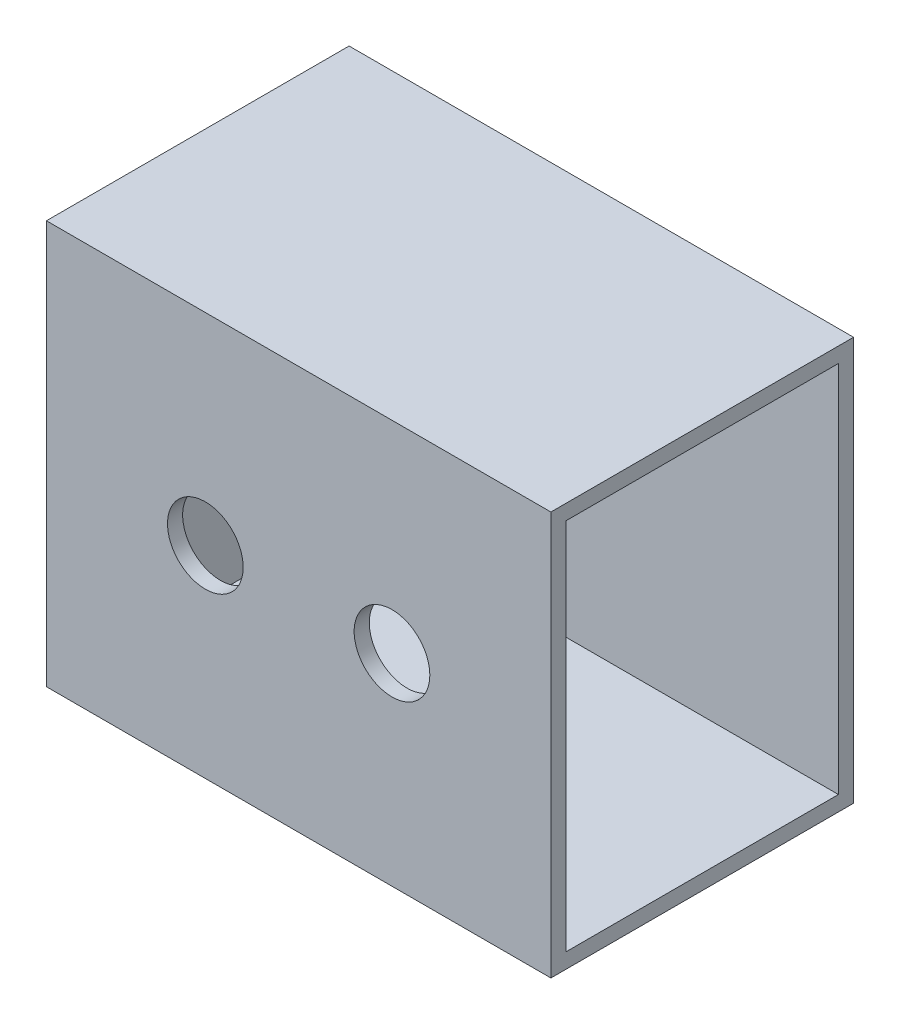
ISO-10303-21;
HEADER;
FILE_DESCRIPTION(('STEP AP214'),'2;1');
FILE_NAME('part.step','',(''),(''),'','','');
FILE_SCHEMA(('AUTOMOTIVE_DESIGN { 1 0 10303 214 1 1 1 1 }'));
ENDSEC;
DATA;
#1=APPLICATION_CONTEXT('core data for automotive mechanical design processes');
#2=APPLICATION_PROTOCOL_DEFINITION('international standard','automotive_design',2000,#1);
#3=PRODUCT_CONTEXT('',#1,'mechanical');
#4=PRODUCT('Part','Part','',(#3));
#5=PRODUCT_RELATED_PRODUCT_CATEGORY('part','',(#4));
#6=PRODUCT_DEFINITION_FORMATION('','',#4);
#7=PRODUCT_DEFINITION_CONTEXT('part definition',#1,'design');
#8=PRODUCT_DEFINITION('design','',#6,#7);
#9=PRODUCT_DEFINITION_SHAPE('','',#8);
#10=(LENGTH_UNIT() NAMED_UNIT(*) SI_UNIT(.MILLI.,.METRE.));
#11=(NAMED_UNIT(*) PLANE_ANGLE_UNIT() SI_UNIT($,.RADIAN.));
#12=(NAMED_UNIT(*) SI_UNIT($,.STERADIAN.) SOLID_ANGLE_UNIT());
#13=UNCERTAINTY_MEASURE_WITH_UNIT(LENGTH_MEASURE(1.E-05),#10,'distance_accuracy_value','');
#14=(GEOMETRIC_REPRESENTATION_CONTEXT(3) GLOBAL_UNCERTAINTY_ASSIGNED_CONTEXT((#13)) GLOBAL_UNIT_ASSIGNED_CONTEXT((#10,
#11,#12)) REPRESENTATION_CONTEXT('',''));
#15=CARTESIAN_POINT('',(0.,0.,0.));
#16=DIRECTION('',(0.,0.,1.));
#17=DIRECTION('',(1.,0.,0.));
#18=AXIS2_PLACEMENT_3D('',#15,#16,#17);
#19=CARTESIAN_POINT('',(46.25,40.,3.));
#20=DIRECTION('',(0.,0.,-1.));
#21=DIRECTION('',(-1.,0.,0.));
#22=AXIS2_PLACEMENT_3D('',#19,#20,#21);
#23=PLANE('',#22);
#24=DIRECTION('',(0.,1.,0.));
#25=VECTOR('',#24,1.);
#26=CARTESIAN_POINT('',(50.,37.,3.));
#27=LINE('',#26,#25);
#28=CARTESIAN_POINT('',(50.,-37.,3.));
#29=VERTEX_POINT('',#28);
#30=CARTESIAN_POINT('',(50.,37.,3.));
#31=VERTEX_POINT('',#30);
#32=EDGE_CURVE('E116',#29,#31,#27,.T.);
#33=ORIENTED_EDGE('',*,*,#32,.T.);
#34=DIRECTION('',(1.,0.,0.));
#35=VECTOR('',#34,1.);
#36=CARTESIAN_POINT('',(-46.25,37.,3.00000000000001));
#37=LINE('',#36,#35);
#38=CARTESIAN_POINT('',(-46.25,37.,3.00000000000001));
#39=VERTEX_POINT('',#38);
#40=EDGE_CURVE('E49',#39,#31,#37,.T.);
#41=ORIENTED_EDGE('',*,*,#40,.F.);
#42=DIRECTION('',(0.,-1.,0.));
#43=VECTOR('',#42,1.);
#44=CARTESIAN_POINT('',(-46.25,40.,3.00000000000001));
#45=LINE('',#44,#43);
#46=CARTESIAN_POINT('',(-46.25,-37.,3.));
#47=VERTEX_POINT('',#46);
#48=EDGE_CURVE('E129',#39,#47,#45,.T.);
#49=ORIENTED_EDGE('',*,*,#48,.T.);
#50=DIRECTION('',(1.,0.,0.));
#51=VECTOR('',#50,1.);
#52=CARTESIAN_POINT('',(46.25,-37.,3.));
#53=LINE('',#52,#51);
#54=EDGE_CURVE('E109',#47,#29,#53,.T.);
#55=ORIENTED_EDGE('',*,*,#54,.T.);
#56=EDGE_LOOP('',(#33,#41,#49,#55));
#57=FACE_BOUND('',#56,.T.);
#58=ADVANCED_FACE('F34',(#57),#23,.F.);
#59=CARTESIAN_POINT('',(-46.25,-37.,60.));
#60=DIRECTION('',(0.,1.,0.));
#61=DIRECTION('',(0.,0.,1.));
#62=AXIS2_PLACEMENT_3D('',#59,#60,#61);
#63=PLANE('',#62);
#64=DIRECTION('',(0.,0.,-1.));
#65=VECTOR('',#64,1.);
#66=CARTESIAN_POINT('',(50.,-37.,57.));
#67=LINE('',#66,#65);
#68=CARTESIAN_POINT('',(50.,-37.,57.));
#69=VERTEX_POINT('',#68);
#70=EDGE_CURVE('E120',#69,#29,#67,.T.);
#71=ORIENTED_EDGE('',*,*,#70,.T.);
#72=ORIENTED_EDGE('',*,*,#54,.F.);
#73=DIRECTION('',(0.,0.,-1.));
#74=VECTOR('',#73,1.);
#75=CARTESIAN_POINT('',(-46.25,-37.,60.));
#76=LINE('',#75,#74);
#77=CARTESIAN_POINT('',(-46.25,-37.,57.));
#78=VERTEX_POINT('',#77);
#79=EDGE_CURVE('E57',#78,#47,#76,.T.);
#80=ORIENTED_EDGE('',*,*,#79,.F.);
#81=DIRECTION('',(-1.,0.,0.));
#82=VECTOR('',#81,1.);
#83=CARTESIAN_POINT('',(46.25,-37.,57.));
#84=LINE('',#83,#82);
#85=EDGE_CURVE('E122',#69,#78,#84,.T.);
#86=ORIENTED_EDGE('',*,*,#85,.F.);
#87=EDGE_LOOP('',(#71,#72,#80,#86));
#88=FACE_BOUND('',#87,.T.);
#89=ADVANCED_FACE('F186',(#88),#63,.T.);
#90=CARTESIAN_POINT('',(-46.25,37.,60.));
#91=DIRECTION('',(1.,0.,0.));
#92=DIRECTION('',(0.,0.,-1.));
#93=AXIS2_PLACEMENT_3D('',#90,#91,#92);
#94=PLANE('',#93);
#95=DIRECTION('',(0.,0.,-1.));
#96=VECTOR('',#95,1.);
#97=CARTESIAN_POINT('',(-46.25,37.,60.));
#98=LINE('',#97,#96);
#99=CARTESIAN_POINT('',(-46.25,37.,57.));
#100=VERTEX_POINT('',#99);
#101=EDGE_CURVE('E133',#100,#39,#98,.T.);
#102=ORIENTED_EDGE('',*,*,#101,.F.);
#103=DIRECTION('',(0.,-1.,0.));
#104=VECTOR('',#103,1.);
#105=CARTESIAN_POINT('',(-46.25,40.,57.));
#106=LINE('',#105,#104);
#107=EDGE_CURVE('E107',#100,#78,#106,.T.);
#108=ORIENTED_EDGE('',*,*,#107,.T.);
#109=ORIENTED_EDGE('',*,*,#79,.T.);
#110=ORIENTED_EDGE('',*,*,#48,.F.);
#111=EDGE_LOOP('',(#102,#108,#109,#110));
#112=FACE_BOUND('',#111,.T.);
#113=ADVANCED_FACE('F192',(#112),#94,.T.);
#114=CARTESIAN_POINT('',(-46.25,37.,60.));
#115=DIRECTION('',(0.,-1.,0.));
#116=DIRECTION('',(0.,0.,-1.));
#117=AXIS2_PLACEMENT_3D('',#114,#115,#116);
#118=PLANE('',#117);
#119=DIRECTION('',(-1.,0.,0.));
#120=VECTOR('',#119,1.);
#121=CARTESIAN_POINT('',(-46.25,37.,57.));
#122=LINE('',#121,#120);
#123=CARTESIAN_POINT('',(50.,37.,57.));
#124=VERTEX_POINT('',#123);
#125=EDGE_CURVE('E102',#124,#100,#122,.T.);
#126=ORIENTED_EDGE('',*,*,#125,.T.);
#127=ORIENTED_EDGE('',*,*,#101,.T.);
#128=ORIENTED_EDGE('',*,*,#40,.T.);
#129=DIRECTION('',(0.,0.,1.));
#130=VECTOR('',#129,1.);
#131=CARTESIAN_POINT('',(50.,37.,57.));
#132=LINE('',#131,#130);
#133=EDGE_CURVE('E112',#31,#124,#132,.T.);
#134=ORIENTED_EDGE('',*,*,#133,.T.);
#135=EDGE_LOOP('',(#126,#127,#128,#134));
#136=FACE_BOUND('',#135,.T.);
#137=ADVANCED_FACE('F113',(#136),#118,.T.);
#138=CARTESIAN_POINT('',(46.25,40.,57.));
#139=DIRECTION('',(0.,0.,1.));
#140=DIRECTION('',(1.,0.,0.));
#141=AXIS2_PLACEMENT_3D('',#138,#139,#140);
#142=PLANE('',#141);
#143=CARTESIAN_POINT('',(18.5,0.,57.));
#144=DIRECTION('',(0.,0.,1.));
#145=DIRECTION('',(1.,0.,0.));
#146=AXIS2_PLACEMENT_3D('',#143,#144,#145);
#147=CIRCLE('',#146,7.5);
#148=CARTESIAN_POINT('',(26.,0.,57.));
#149=VERTEX_POINT('',#148);
#150=EDGE_CURVE('E227',#149,#149,#147,.T.);
#151=ORIENTED_EDGE('',*,*,#150,.T.);
#152=EDGE_LOOP('',(#151));
#153=FACE_BOUND('',#152,.T.);
#154=CARTESIAN_POINT('',(-18.5,0.,57.));
#155=DIRECTION('',(0.,0.,1.));
#156=DIRECTION('',(1.,0.,0.));
#157=AXIS2_PLACEMENT_3D('',#154,#155,#156);
#158=CIRCLE('',#157,7.5);
#159=CARTESIAN_POINT('',(-11.,0.,57.));
#160=VERTEX_POINT('',#159);
#161=EDGE_CURVE('E225',#160,#160,#158,.T.);
#162=ORIENTED_EDGE('',*,*,#161,.T.);
#163=EDGE_LOOP('',(#162));
#164=FACE_BOUND('',#163,.T.);
#165=ORIENTED_EDGE('',*,*,#85,.T.);
#166=ORIENTED_EDGE('',*,*,#107,.F.);
#167=ORIENTED_EDGE('',*,*,#125,.F.);
#168=DIRECTION('',(0.,-1.,0.));
#169=VECTOR('',#168,1.);
#170=CARTESIAN_POINT('',(50.,37.,57.));
#171=LINE('',#170,#169);
#172=EDGE_CURVE('E105',#124,#69,#171,.T.);
#173=ORIENTED_EDGE('',*,*,#172,.T.);
#174=EDGE_LOOP('',(#165,#166,#167,#173));
#175=FACE_BOUND('',#174,.T.);
#176=ADVANCED_FACE('F103',(#153,#164,#175),#142,.F.);
#177=CARTESIAN_POINT('',(0.,0.,60.));
#178=DIRECTION('',(0.,0.,1.));
#179=DIRECTION('',(1.,0.,0.));
#180=AXIS2_PLACEMENT_3D('',#177,#178,#179);
#181=PLANE('',#180);
#182=CARTESIAN_POINT('',(18.5,0.,60.));
#183=DIRECTION('',(0.,0.,1.));
#184=DIRECTION('',(1.,0.,0.));
#185=AXIS2_PLACEMENT_3D('',#182,#183,#184);
#186=CIRCLE('',#185,7.5);
#187=CARTESIAN_POINT('',(26.,0.,60.));
#188=VERTEX_POINT('',#187);
#189=EDGE_CURVE('E228',#188,#188,#186,.T.);
#190=ORIENTED_EDGE('',*,*,#189,.F.);
#191=EDGE_LOOP('',(#190));
#192=FACE_BOUND('',#191,.T.);
#193=CARTESIAN_POINT('',(-18.5,0.,60.));
#194=DIRECTION('',(0.,0.,1.));
#195=DIRECTION('',(1.,0.,0.));
#196=AXIS2_PLACEMENT_3D('',#193,#194,#195);
#197=CIRCLE('',#196,7.5);
#198=CARTESIAN_POINT('',(-11.,0.,60.));
#199=VERTEX_POINT('',#198);
#200=EDGE_CURVE('E222',#199,#199,#197,.T.);
#201=ORIENTED_EDGE('',*,*,#200,.F.);
#202=EDGE_LOOP('',(#201));
#203=FACE_BOUND('',#202,.T.);
#204=DIRECTION('',(-1.,0.,0.));
#205=VECTOR('',#204,1.);
#206=CARTESIAN_POINT('',(-50.,40.,60.));
#207=LINE('',#206,#205);
#208=CARTESIAN_POINT('',(50.,40.,60.));
#209=VERTEX_POINT('',#208);
#210=CARTESIAN_POINT('',(-50.,40.,60.));
#211=VERTEX_POINT('',#210);
#212=EDGE_CURVE('E139',#209,#211,#207,.T.);
#213=ORIENTED_EDGE('',*,*,#212,.T.);
#214=DIRECTION('',(0.,-1.,0.));
#215=VECTOR('',#214,1.);
#216=CARTESIAN_POINT('',(-50.,40.,60.));
#217=LINE('',#216,#215);
#218=CARTESIAN_POINT('',(-50.,-40.,60.));
#219=VERTEX_POINT('',#218);
#220=EDGE_CURVE('E142',#211,#219,#217,.T.);
#221=ORIENTED_EDGE('',*,*,#220,.T.);
#222=DIRECTION('',(1.,0.,0.));
#223=VECTOR('',#222,1.);
#224=CARTESIAN_POINT('',(-50.,-40.,60.));
#225=LINE('',#224,#223);
#226=CARTESIAN_POINT('',(50.,-40.,60.));
#227=VERTEX_POINT('',#226);
#228=EDGE_CURVE('E144',#219,#227,#225,.T.);
#229=ORIENTED_EDGE('',*,*,#228,.T.);
#230=DIRECTION('',(0.,1.,0.));
#231=VECTOR('',#230,1.);
#232=CARTESIAN_POINT('',(50.,40.,60.));
#233=LINE('',#232,#231);
#234=EDGE_CURVE('E136',#227,#209,#233,.T.);
#235=ORIENTED_EDGE('',*,*,#234,.T.);
#236=EDGE_LOOP('',(#213,#221,#229,#235));
#237=FACE_BOUND('',#236,.T.);
#238=ADVANCED_FACE('F177',(#192,#203,#237),#181,.T.);
#239=CARTESIAN_POINT('',(0.,0.,0.));
#240=DIRECTION('',(0.,0.,1.));
#241=DIRECTION('',(1.,0.,0.));
#242=AXIS2_PLACEMENT_3D('',#239,#240,#241);
#243=PLANE('',#242);
#244=DIRECTION('',(0.,-1.,0.));
#245=VECTOR('',#244,1.);
#246=CARTESIAN_POINT('',(-50.,40.,0.));
#247=LINE('',#246,#245);
#248=CARTESIAN_POINT('',(-50.,40.,0.));
#249=VERTEX_POINT('',#248);
#250=CARTESIAN_POINT('',(-50.,-40.,0.));
#251=VERTEX_POINT('',#250);
#252=EDGE_CURVE('E151',#249,#251,#247,.T.);
#253=ORIENTED_EDGE('',*,*,#252,.F.);
#254=DIRECTION('',(-1.,0.,0.));
#255=VECTOR('',#254,1.);
#256=CARTESIAN_POINT('',(-50.,40.,0.));
#257=LINE('',#256,#255);
#258=CARTESIAN_POINT('',(50.,40.,0.));
#259=VERTEX_POINT('',#258);
#260=EDGE_CURVE('E149',#259,#249,#257,.T.);
#261=ORIENTED_EDGE('',*,*,#260,.F.);
#262=DIRECTION('',(0.,1.,0.));
#263=VECTOR('',#262,1.);
#264=CARTESIAN_POINT('',(50.,40.,0.));
#265=LINE('',#264,#263);
#266=CARTESIAN_POINT('',(50.,-40.,0.));
#267=VERTEX_POINT('',#266);
#268=EDGE_CURVE('E135',#267,#259,#265,.T.);
#269=ORIENTED_EDGE('',*,*,#268,.F.);
#270=DIRECTION('',(1.,0.,0.));
#271=VECTOR('',#270,1.);
#272=CARTESIAN_POINT('',(-50.,-40.,0.));
#273=LINE('',#272,#271);
#274=EDGE_CURVE('E140',#251,#267,#273,.T.);
#275=ORIENTED_EDGE('',*,*,#274,.F.);
#276=EDGE_LOOP('',(#253,#261,#269,#275));
#277=FACE_BOUND('',#276,.T.);
#278=ADVANCED_FACE('F168',(#277),#243,.F.);
#279=CARTESIAN_POINT('',(50.,40.,60.));
#280=DIRECTION('',(-1.,0.,0.));
#281=DIRECTION('',(0.,-1.,0.));
#282=AXIS2_PLACEMENT_3D('',#279,#280,#281);
#283=PLANE('',#282);
#284=ORIENTED_EDGE('',*,*,#133,.F.);
#285=ORIENTED_EDGE('',*,*,#32,.F.);
#286=ORIENTED_EDGE('',*,*,#70,.F.);
#287=ORIENTED_EDGE('',*,*,#172,.F.);
#288=EDGE_LOOP('',(#284,#285,#286,#287));
#289=FACE_BOUND('',#288,.T.);
#290=ORIENTED_EDGE('',*,*,#268,.T.);
#291=DIRECTION('',(0.,0.,-1.));
#292=VECTOR('',#291,1.);
#293=CARTESIAN_POINT('',(50.,40.,60.));
#294=LINE('',#293,#292);
#295=EDGE_CURVE('E12',#209,#259,#294,.T.);
#296=ORIENTED_EDGE('',*,*,#295,.F.);
#297=ORIENTED_EDGE('',*,*,#234,.F.);
#298=DIRECTION('',(0.,0.,-1.));
#299=VECTOR('',#298,1.);
#300=CARTESIAN_POINT('',(50.,-40.,60.));
#301=LINE('',#300,#299);
#302=EDGE_CURVE('E146',#227,#267,#301,.T.);
#303=ORIENTED_EDGE('',*,*,#302,.T.);
#304=EDGE_LOOP('',(#290,#296,#297,#303));
#305=FACE_BOUND('',#304,.T.);
#306=ADVANCED_FACE('F36',(#289,#305),#283,.F.);
#307=CARTESIAN_POINT('',(-50.,40.,60.));
#308=DIRECTION('',(0.,-1.,0.));
#309=DIRECTION('',(0.,0.,-1.));
#310=AXIS2_PLACEMENT_3D('',#307,#308,#309);
#311=PLANE('',#310);
#312=DIRECTION('',(0.,0.,-1.));
#313=VECTOR('',#312,1.);
#314=CARTESIAN_POINT('',(-50.,40.,60.));
#315=LINE('',#314,#313);
#316=EDGE_CURVE('E42',#211,#249,#315,.T.);
#317=ORIENTED_EDGE('',*,*,#316,.F.);
#318=ORIENTED_EDGE('',*,*,#212,.F.);
#319=ORIENTED_EDGE('',*,*,#295,.T.);
#320=ORIENTED_EDGE('',*,*,#260,.T.);
#321=EDGE_LOOP('',(#317,#318,#319,#320));
#322=FACE_BOUND('',#321,.T.);
#323=ADVANCED_FACE('F178',(#322),#311,.F.);
#324=CARTESIAN_POINT('',(-50.,40.,60.));
#325=DIRECTION('',(1.,0.,0.));
#326=DIRECTION('',(0.,1.,0.));
#327=AXIS2_PLACEMENT_3D('',#324,#325,#326);
#328=PLANE('',#327);
#329=ORIENTED_EDGE('',*,*,#252,.T.);
#330=DIRECTION('',(0.,0.,-1.));
#331=VECTOR('',#330,1.);
#332=CARTESIAN_POINT('',(-50.,-40.,60.));
#333=LINE('',#332,#331);
#334=EDGE_CURVE('E156',#219,#251,#333,.T.);
#335=ORIENTED_EDGE('',*,*,#334,.F.);
#336=ORIENTED_EDGE('',*,*,#220,.F.);
#337=ORIENTED_EDGE('',*,*,#316,.T.);
#338=EDGE_LOOP('',(#329,#335,#336,#337));
#339=FACE_BOUND('',#338,.T.);
#340=ADVANCED_FACE('F163',(#339),#328,.F.);
#341=CARTESIAN_POINT('',(-50.,-40.,60.));
#342=DIRECTION('',(0.,1.,0.));
#343=DIRECTION('',(0.,0.,1.));
#344=AXIS2_PLACEMENT_3D('',#341,#342,#343);
#345=PLANE('',#344);
#346=ORIENTED_EDGE('',*,*,#274,.T.);
#347=ORIENTED_EDGE('',*,*,#302,.F.);
#348=ORIENTED_EDGE('',*,*,#228,.F.);
#349=ORIENTED_EDGE('',*,*,#334,.T.);
#350=EDGE_LOOP('',(#346,#347,#348,#349));
#351=FACE_BOUND('',#350,.T.);
#352=ADVANCED_FACE('F172',(#351),#345,.F.);
#353=CARTESIAN_POINT('',(-18.5,0.,50.));
#354=DIRECTION('',(0.,0.,1.));
#355=DIRECTION('',(1.,0.,0.));
#356=AXIS2_PLACEMENT_3D('',#353,#354,#355);
#357=CYLINDRICAL_SURFACE('',#356,7.5);
#358=ORIENTED_EDGE('',*,*,#200,.T.);
#359=EDGE_LOOP('',(#358));
#360=FACE_BOUND('',#359,.T.);
#361=ORIENTED_EDGE('',*,*,#161,.F.);
#362=EDGE_LOOP('',(#361));
#363=FACE_BOUND('',#362,.T.);
#364=ADVANCED_FACE('F208',(#360,#363),#357,.F.);
#365=CARTESIAN_POINT('',(18.5,0.,50.));
#366=DIRECTION('',(0.,0.,1.));
#367=DIRECTION('',(1.,0.,0.));
#368=AXIS2_PLACEMENT_3D('',#365,#366,#367);
#369=CYLINDRICAL_SURFACE('',#368,7.5);
#370=ORIENTED_EDGE('',*,*,#189,.T.);
#371=EDGE_LOOP('',(#370));
#372=FACE_BOUND('',#371,.T.);
#373=ORIENTED_EDGE('',*,*,#150,.F.);
#374=EDGE_LOOP('',(#373));
#375=FACE_BOUND('',#374,.T.);
#376=ADVANCED_FACE('F212',(#372,#375),#369,.F.);
#377=CLOSED_SHELL('',(#58,#89,#113,#137,#176,#238,#278,#306,#323,#340,#352,#364,#376));
#378=MANIFOLD_SOLID_BREP('B2',#377);
#379=ADVANCED_BREP_SHAPE_REPRESENTATION('',(#18,#378),#14);
#380=SHAPE_DEFINITION_REPRESENTATION(#9,#379);
ENDSEC;
END-ISO-10303-21;
